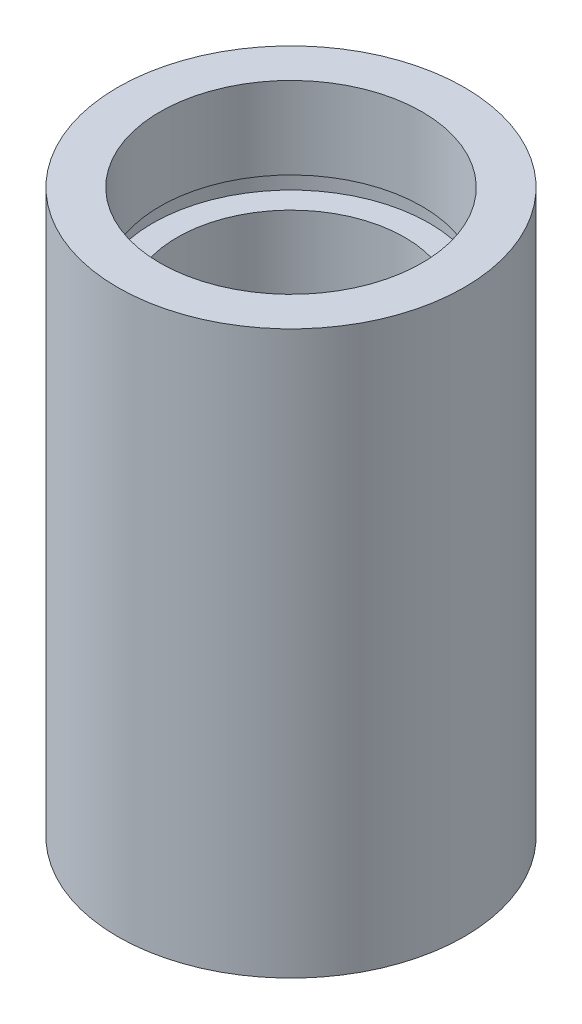
ISO-10303-21;
HEADER;
FILE_DESCRIPTION(('STEP AP214'),'2;1');
FILE_NAME('part.step','',(''),(''),'','','');
FILE_SCHEMA(('AUTOMOTIVE_DESIGN { 1 0 10303 214 1 1 1 1 }'));
ENDSEC;
DATA;
#1=APPLICATION_CONTEXT('core data for automotive mechanical design processes');
#2=APPLICATION_PROTOCOL_DEFINITION('international standard','automotive_design',2000,#1);
#3=PRODUCT_CONTEXT('',#1,'mechanical');
#4=PRODUCT('Part','Part','',(#3));
#5=PRODUCT_RELATED_PRODUCT_CATEGORY('part','',(#4));
#6=PRODUCT_DEFINITION_FORMATION('','',#4);
#7=PRODUCT_DEFINITION_CONTEXT('part definition',#1,'design');
#8=PRODUCT_DEFINITION('design','',#6,#7);
#9=PRODUCT_DEFINITION_SHAPE('','',#8);
#10=(LENGTH_UNIT() NAMED_UNIT(*) SI_UNIT(.MILLI.,.METRE.));
#11=(NAMED_UNIT(*) PLANE_ANGLE_UNIT() SI_UNIT($,.RADIAN.));
#12=(NAMED_UNIT(*) SI_UNIT($,.STERADIAN.) SOLID_ANGLE_UNIT());
#13=UNCERTAINTY_MEASURE_WITH_UNIT(LENGTH_MEASURE(1.E-05),#10,'distance_accuracy_value','');
#14=(GEOMETRIC_REPRESENTATION_CONTEXT(3) GLOBAL_UNCERTAINTY_ASSIGNED_CONTEXT((#13)) GLOBAL_UNIT_ASSIGNED_CONTEXT((#10,
#11,#12)) REPRESENTATION_CONTEXT('',''));
#15=CARTESIAN_POINT('',(0.,0.,0.));
#16=DIRECTION('',(0.,0.,1.));
#17=DIRECTION('',(1.,0.,0.));
#18=AXIS2_PLACEMENT_3D('',#15,#16,#17);
#19=CARTESIAN_POINT('',(7.00000000000002,0.,0.));
#20=DIRECTION('',(0.,1.,0.));
#21=DIRECTION('',(0.,0.,1.));
#22=AXIS2_PLACEMENT_3D('',#19,#20,#21);
#23=PLANE('',#22);
#24=CARTESIAN_POINT('',(0.,0.,0.));
#25=DIRECTION('',(0.,1.,0.));
#26=DIRECTION('',(0.,0.,1.));
#27=AXIS2_PLACEMENT_3D('',#24,#25,#26);
#28=CIRCLE('',#27,9.52500000000002);
#29=CARTESIAN_POINT('',(0.,0.,9.52500000000002));
#30=VERTEX_POINT('',#29);
#31=EDGE_CURVE('E10',#30,#30,#28,.T.);
#32=ORIENTED_EDGE('',*,*,#31,.F.);
#33=EDGE_LOOP('',(#32));
#34=FACE_BOUND('',#33,.T.);
#35=CARTESIAN_POINT('',(0.,0.,0.));
#36=DIRECTION('',(0.,1.,0.));
#37=DIRECTION('',(0.,0.,1.));
#38=AXIS2_PLACEMENT_3D('',#35,#36,#37);
#39=CIRCLE('',#38,7.00000000000002);
#40=CARTESIAN_POINT('',(0.,0.,7.00000000000002));
#41=VERTEX_POINT('',#40);
#42=EDGE_CURVE('E77',#41,#41,#39,.T.);
#43=ORIENTED_EDGE('',*,*,#42,.T.);
#44=EDGE_LOOP('',(#43));
#45=FACE_BOUND('',#44,.T.);
#46=ADVANCED_FACE('F37',(#34,#45),#23,.F.);
#47=CARTESIAN_POINT('',(0.,161.376166943427,0.));
#48=DIRECTION('',(0.,1.,0.));
#49=DIRECTION('',(0.,0.,1.));
#50=AXIS2_PLACEMENT_3D('',#47,#48,#49);
#51=CYLINDRICAL_SURFACE('',#50,9.52500000000002);
#52=CARTESIAN_POINT('',(0.,30.9,0.));
#53=DIRECTION('',(0.,1.,0.));
#54=DIRECTION('',(0.,0.,1.));
#55=AXIS2_PLACEMENT_3D('',#52,#53,#54);
#56=CIRCLE('',#55,9.52500000000002);
#57=CARTESIAN_POINT('',(0.,30.9,9.52500000000002));
#58=VERTEX_POINT('',#57);
#59=EDGE_CURVE('E43',#58,#58,#56,.T.);
#60=ORIENTED_EDGE('',*,*,#59,.F.);
#61=EDGE_LOOP('',(#60));
#62=FACE_BOUND('',#61,.T.);
#63=ORIENTED_EDGE('',*,*,#31,.T.);
#64=EDGE_LOOP('',(#63));
#65=FACE_BOUND('',#64,.T.);
#66=ADVANCED_FACE('F138',(#62,#65),#51,.T.);
#67=CARTESIAN_POINT('',(7.20000000000001,30.9,0.));
#68=DIRECTION('',(0.,-1.,0.));
#69=DIRECTION('',(0.,0.,-1.));
#70=AXIS2_PLACEMENT_3D('',#67,#68,#69);
#71=PLANE('',#70);
#72=CARTESIAN_POINT('',(0.,30.9,0.));
#73=DIRECTION('',(0.,1.,0.));
#74=DIRECTION('',(0.,0.,1.));
#75=AXIS2_PLACEMENT_3D('',#72,#73,#74);
#76=CIRCLE('',#75,7.20000000000001);
#77=CARTESIAN_POINT('',(0.,30.9,7.20000000000001));
#78=VERTEX_POINT('',#77);
#79=EDGE_CURVE('E47',#78,#78,#76,.T.);
#80=ORIENTED_EDGE('',*,*,#79,.F.);
#81=EDGE_LOOP('',(#80));
#82=FACE_BOUND('',#81,.T.);
#83=ORIENTED_EDGE('',*,*,#59,.T.);
#84=EDGE_LOOP('',(#83));
#85=FACE_BOUND('',#84,.T.);
#86=ADVANCED_FACE('F133',(#82,#85),#71,.F.);
#87=CARTESIAN_POINT('',(0.,161.376166943427,0.));
#88=DIRECTION('',(0.,1.,0.));
#89=DIRECTION('',(0.,0.,1.));
#90=AXIS2_PLACEMENT_3D('',#87,#88,#89);
#91=CYLINDRICAL_SURFACE('',#90,7.20000000000002);
#92=CARTESIAN_POINT('',(0.,26.4,0.));
#93=DIRECTION('',(0.,1.,0.));
#94=DIRECTION('',(0.,0.,1.));
#95=AXIS2_PLACEMENT_3D('',#92,#93,#94);
#96=CIRCLE('',#95,7.20000000000002);
#97=CARTESIAN_POINT('',(0.,26.4,7.20000000000002));
#98=VERTEX_POINT('',#97);
#99=EDGE_CURVE('E51',#98,#98,#96,.T.);
#100=ORIENTED_EDGE('',*,*,#99,.F.);
#101=EDGE_LOOP('',(#100));
#102=FACE_BOUND('',#101,.T.);
#103=ORIENTED_EDGE('',*,*,#79,.T.);
#104=EDGE_LOOP('',(#103));
#105=FACE_BOUND('',#104,.T.);
#106=ADVANCED_FACE('F127',(#102,#105),#91,.F.);
#107=CARTESIAN_POINT('',(7.20000000000002,26.4,0.));
#108=DIRECTION('',(0.,1.,0.));
#109=DIRECTION('',(0.,0.,1.));
#110=AXIS2_PLACEMENT_3D('',#107,#108,#109);
#111=PLANE('',#110);
#112=CARTESIAN_POINT('',(0.,26.4,0.));
#113=DIRECTION('',(0.,1.,0.));
#114=DIRECTION('',(0.,0.,1.));
#115=AXIS2_PLACEMENT_3D('',#112,#113,#114);
#116=CIRCLE('',#115,7.60000000000002);
#117=CARTESIAN_POINT('',(0.,26.4,7.60000000000002));
#118=VERTEX_POINT('',#117);
#119=EDGE_CURVE('E56',#118,#118,#116,.T.);
#120=ORIENTED_EDGE('',*,*,#119,.F.);
#121=EDGE_LOOP('',(#120));
#122=FACE_BOUND('',#121,.T.);
#123=ORIENTED_EDGE('',*,*,#99,.T.);
#124=EDGE_LOOP('',(#123));
#125=FACE_BOUND('',#124,.T.);
#126=ADVANCED_FACE('F121',(#122,#125),#111,.F.);
#127=CARTESIAN_POINT('',(0.,161.376166943427,0.));
#128=DIRECTION('',(0.,1.,0.));
#129=DIRECTION('',(0.,0.,1.));
#130=AXIS2_PLACEMENT_3D('',#127,#128,#129);
#131=CYLINDRICAL_SURFACE('',#130,7.60000000000002);
#132=CARTESIAN_POINT('',(0.,25.4,0.));
#133=DIRECTION('',(0.,1.,0.));
#134=DIRECTION('',(0.,0.,1.));
#135=AXIS2_PLACEMENT_3D('',#132,#133,#134);
#136=CIRCLE('',#135,7.60000000000002);
#137=CARTESIAN_POINT('',(0.,25.4,7.60000000000002));
#138=VERTEX_POINT('',#137);
#139=EDGE_CURVE('E59',#138,#138,#136,.T.);
#140=ORIENTED_EDGE('',*,*,#139,.F.);
#141=EDGE_LOOP('',(#140));
#142=FACE_BOUND('',#141,.T.);
#143=ORIENTED_EDGE('',*,*,#119,.T.);
#144=EDGE_LOOP('',(#143));
#145=FACE_BOUND('',#144,.T.);
#146=ADVANCED_FACE('F115',(#142,#145),#131,.F.);
#147=CARTESIAN_POINT('',(6.25000000000002,25.4,0.));
#148=DIRECTION('',(0.,-1.,0.));
#149=DIRECTION('',(0.,0.,-1.));
#150=AXIS2_PLACEMENT_3D('',#147,#148,#149);
#151=PLANE('',#150);
#152=CARTESIAN_POINT('',(0.,25.4,0.));
#153=DIRECTION('',(0.,1.,0.));
#154=DIRECTION('',(0.,0.,1.));
#155=AXIS2_PLACEMENT_3D('',#152,#153,#154);
#156=CIRCLE('',#155,6.25000000000002);
#157=CARTESIAN_POINT('',(0.,25.4,6.25000000000002));
#158=VERTEX_POINT('',#157);
#159=EDGE_CURVE('E62',#158,#158,#156,.T.);
#160=ORIENTED_EDGE('',*,*,#159,.F.);
#161=EDGE_LOOP('',(#160));
#162=FACE_BOUND('',#161,.T.);
#163=ORIENTED_EDGE('',*,*,#139,.T.);
#164=EDGE_LOOP('',(#163));
#165=FACE_BOUND('',#164,.T.);
#166=ADVANCED_FACE('F109',(#162,#165),#151,.F.);
#167=CARTESIAN_POINT('',(0.,161.376166943427,0.));
#168=DIRECTION('',(0.,1.,0.));
#169=DIRECTION('',(0.,0.,1.));
#170=AXIS2_PLACEMENT_3D('',#167,#168,#169);
#171=CYLINDRICAL_SURFACE('',#170,6.25000000000002);
#172=CARTESIAN_POINT('',(0.,5.49999999999998,0.));
#173=DIRECTION('',(0.,1.,0.));
#174=DIRECTION('',(0.,0.,1.));
#175=AXIS2_PLACEMENT_3D('',#172,#173,#174);
#176=CIRCLE('',#175,6.25000000000002);
#177=CARTESIAN_POINT('',(0.,5.49999999999998,6.25000000000002));
#178=VERTEX_POINT('',#177);
#179=EDGE_CURVE('E65',#178,#178,#176,.T.);
#180=ORIENTED_EDGE('',*,*,#179,.F.);
#181=EDGE_LOOP('',(#180));
#182=FACE_BOUND('',#181,.T.);
#183=ORIENTED_EDGE('',*,*,#159,.T.);
#184=EDGE_LOOP('',(#183));
#185=FACE_BOUND('',#184,.T.);
#186=ADVANCED_FACE('F103',(#182,#185),#171,.F.);
#187=CARTESIAN_POINT('',(6.25000000000002,5.49999999999998,0.));
#188=DIRECTION('',(0.,1.,0.));
#189=DIRECTION('',(0.,0.,1.));
#190=AXIS2_PLACEMENT_3D('',#187,#188,#189);
#191=PLANE('',#190);
#192=CARTESIAN_POINT('',(0.,5.49999999999998,0.));
#193=DIRECTION('',(0.,1.,0.));
#194=DIRECTION('',(0.,0.,1.));
#195=AXIS2_PLACEMENT_3D('',#192,#193,#194);
#196=CIRCLE('',#195,7.60000000000002);
#197=CARTESIAN_POINT('',(0.,5.49999999999998,7.60000000000002));
#198=VERTEX_POINT('',#197);
#199=EDGE_CURVE('E68',#198,#198,#196,.T.);
#200=ORIENTED_EDGE('',*,*,#199,.F.);
#201=EDGE_LOOP('',(#200));
#202=FACE_BOUND('',#201,.T.);
#203=ORIENTED_EDGE('',*,*,#179,.T.);
#204=EDGE_LOOP('',(#203));
#205=FACE_BOUND('',#204,.T.);
#206=ADVANCED_FACE('F97',(#202,#205),#191,.F.);
#207=CARTESIAN_POINT('',(0.,161.376166943427,0.));
#208=DIRECTION('',(0.,1.,0.));
#209=DIRECTION('',(0.,0.,1.));
#210=AXIS2_PLACEMENT_3D('',#207,#208,#209);
#211=CYLINDRICAL_SURFACE('',#210,7.60000000000002);
#212=CARTESIAN_POINT('',(0.,4.49999999999998,0.));
#213=DIRECTION('',(0.,1.,0.));
#214=DIRECTION('',(0.,0.,1.));
#215=AXIS2_PLACEMENT_3D('',#212,#213,#214);
#216=CIRCLE('',#215,7.60000000000002);
#217=CARTESIAN_POINT('',(0.,4.49999999999998,7.60000000000002));
#218=VERTEX_POINT('',#217);
#219=EDGE_CURVE('E71',#218,#218,#216,.T.);
#220=ORIENTED_EDGE('',*,*,#219,.F.);
#221=EDGE_LOOP('',(#220));
#222=FACE_BOUND('',#221,.T.);
#223=ORIENTED_EDGE('',*,*,#199,.T.);
#224=EDGE_LOOP('',(#223));
#225=FACE_BOUND('',#224,.T.);
#226=ADVANCED_FACE('F91',(#222,#225),#211,.F.);
#227=CARTESIAN_POINT('',(7.00000000000002,4.49999999999998,0.));
#228=DIRECTION('',(0.,-1.,0.));
#229=DIRECTION('',(0.,0.,-1.));
#230=AXIS2_PLACEMENT_3D('',#227,#228,#229);
#231=PLANE('',#230);
#232=CARTESIAN_POINT('',(0.,4.49999999999998,0.));
#233=DIRECTION('',(0.,1.,0.));
#234=DIRECTION('',(0.,0.,1.));
#235=AXIS2_PLACEMENT_3D('',#232,#233,#234);
#236=CIRCLE('',#235,7.00000000000002);
#237=CARTESIAN_POINT('',(0.,4.49999999999998,7.00000000000002));
#238=VERTEX_POINT('',#237);
#239=EDGE_CURVE('E74',#238,#238,#236,.T.);
#240=ORIENTED_EDGE('',*,*,#239,.F.);
#241=EDGE_LOOP('',(#240));
#242=FACE_BOUND('',#241,.T.);
#243=ORIENTED_EDGE('',*,*,#219,.T.);
#244=EDGE_LOOP('',(#243));
#245=FACE_BOUND('',#244,.T.);
#246=ADVANCED_FACE('F85',(#242,#245),#231,.F.);
#247=CARTESIAN_POINT('',(0.,161.376166943427,0.));
#248=DIRECTION('',(0.,1.,0.));
#249=DIRECTION('',(0.,0.,1.));
#250=AXIS2_PLACEMENT_3D('',#247,#248,#249);
#251=CYLINDRICAL_SURFACE('',#250,7.00000000000002);
#252=ORIENTED_EDGE('',*,*,#42,.F.);
#253=EDGE_LOOP('',(#252));
#254=FACE_BOUND('',#253,.T.);
#255=ORIENTED_EDGE('',*,*,#239,.T.);
#256=EDGE_LOOP('',(#255));
#257=FACE_BOUND('',#256,.T.);
#258=ADVANCED_FACE('F82',(#254,#257),#251,.F.);
#259=CLOSED_SHELL('',(#46,#66,#86,#106,#126,#146,#166,#186,#206,#226,#246,#258));
#260=MANIFOLD_SOLID_BREP('B2',#259);
#261=ADVANCED_BREP_SHAPE_REPRESENTATION('',(#18,#260),#14);
#262=SHAPE_DEFINITION_REPRESENTATION(#9,#261);
ENDSEC;
END-ISO-10303-21;
